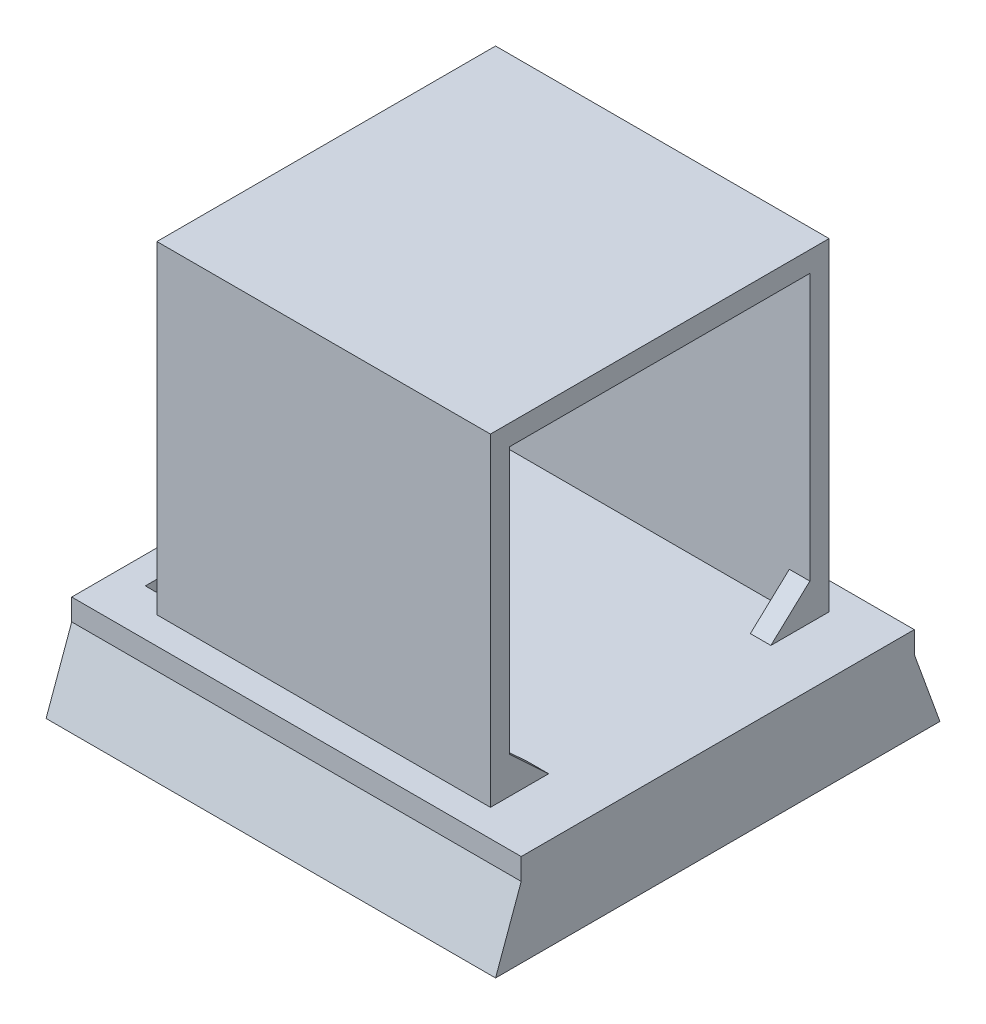
ISO-10303-21;
HEADER;
FILE_DESCRIPTION(('STEP AP214'),'2;1');
FILE_NAME('part.step','',(''),(''),'','','');
FILE_SCHEMA(('AUTOMOTIVE_DESIGN { 1 0 10303 214 1 1 1 1 }'));
ENDSEC;
DATA;
#1=APPLICATION_CONTEXT('core data for automotive mechanical design processes');
#2=APPLICATION_PROTOCOL_DEFINITION('international standard','automotive_design',2000,#1);
#3=PRODUCT_CONTEXT('',#1,'mechanical');
#4=PRODUCT('Part','Part','',(#3));
#5=PRODUCT_RELATED_PRODUCT_CATEGORY('part','',(#4));
#6=PRODUCT_DEFINITION_FORMATION('','',#4);
#7=PRODUCT_DEFINITION_CONTEXT('part definition',#1,'design');
#8=PRODUCT_DEFINITION('design','',#6,#7);
#9=PRODUCT_DEFINITION_SHAPE('','',#8);
#10=(LENGTH_UNIT() NAMED_UNIT(*) SI_UNIT(.MILLI.,.METRE.));
#11=(NAMED_UNIT(*) PLANE_ANGLE_UNIT() SI_UNIT($,.RADIAN.));
#12=(NAMED_UNIT(*) SI_UNIT($,.STERADIAN.) SOLID_ANGLE_UNIT());
#13=UNCERTAINTY_MEASURE_WITH_UNIT(LENGTH_MEASURE(1.E-05),#10,'distance_accuracy_value','');
#14=(GEOMETRIC_REPRESENTATION_CONTEXT(3) GLOBAL_UNCERTAINTY_ASSIGNED_CONTEXT((#13)) GLOBAL_UNIT_ASSIGNED_CONTEXT((#10,
#11,#12)) REPRESENTATION_CONTEXT('',''));
#15=CARTESIAN_POINT('',(0.,0.,0.));
#16=DIRECTION('',(0.,0.,1.));
#17=DIRECTION('',(1.,0.,0.));
#18=AXIS2_PLACEMENT_3D('',#15,#16,#17);
#19=CARTESIAN_POINT('',(-16.25,17.,2.65));
#20=DIRECTION('',(1.,0.,0.));
#21=DIRECTION('',(0.,1.,0.));
#22=AXIS2_PLACEMENT_3D('',#19,#20,#21);
#23=PLANE('',#22);
#24=DIRECTION('',(0.,1.,0.));
#25=VECTOR('',#24,1.);
#26=CARTESIAN_POINT('',(-16.25,17.,33.775));
#27=LINE('',#26,#25);
#28=CARTESIAN_POINT('',(-16.25,-14.5,33.775));
#29=VERTEX_POINT('',#28);
#30=CARTESIAN_POINT('',(-16.25,15.,33.775));
#31=VERTEX_POINT('',#30);
#32=EDGE_CURVE('E268',#29,#31,#27,.T.);
#33=ORIENTED_EDGE('',*,*,#32,.F.);
#34=DIRECTION('',(0.,0.,1.));
#35=VECTOR('',#34,1.);
#36=CARTESIAN_POINT('',(-16.25,-14.5,2.65));
#37=LINE('',#36,#35);
#38=CARTESIAN_POINT('',(-16.25,-14.5,35.65));
#39=VERTEX_POINT('',#38);
#40=EDGE_CURVE('E289',#29,#39,#37,.T.);
#41=ORIENTED_EDGE('',*,*,#40,.T.);
#42=DIRECTION('',(0.,1.,0.));
#43=VECTOR('',#42,1.);
#44=CARTESIAN_POINT('',(-16.25,17.,35.65));
#45=LINE('',#44,#43);
#46=CARTESIAN_POINT('',(-16.25,17.,35.65));
#47=VERTEX_POINT('',#46);
#48=EDGE_CURVE('E270',#39,#47,#45,.T.);
#49=ORIENTED_EDGE('',*,*,#48,.T.);
#50=DIRECTION('',(0.,0.,1.));
#51=VECTOR('',#50,1.);
#52=CARTESIAN_POINT('',(-16.25,17.,2.65));
#53=LINE('',#52,#51);
#54=CARTESIAN_POINT('',(-16.25,17.,2.65));
#55=VERTEX_POINT('',#54);
#56=EDGE_CURVE('E297',#55,#47,#53,.T.);
#57=ORIENTED_EDGE('',*,*,#56,.F.);
#58=DIRECTION('',(0.,1.,0.));
#59=VECTOR('',#58,1.);
#60=CARTESIAN_POINT('',(-16.25,17.,2.65));
#61=LINE('',#60,#59);
#62=CARTESIAN_POINT('',(-16.25,-14.5,2.65));
#63=VERTEX_POINT('',#62);
#64=EDGE_CURVE('E280',#63,#55,#61,.T.);
#65=ORIENTED_EDGE('',*,*,#64,.F.);
#66=CARTESIAN_POINT('',(-16.25,-14.5,4.52499999999999));
#67=VERTEX_POINT('',#66);
#68=EDGE_CURVE('E290',#63,#67,#37,.T.);
#69=ORIENTED_EDGE('',*,*,#68,.T.);
#70=DIRECTION('',(0.,1.,0.));
#71=VECTOR('',#70,1.);
#72=CARTESIAN_POINT('',(-16.25,17.,4.525));
#73=LINE('',#72,#71);
#74=CARTESIAN_POINT('',(-16.25,15.,4.525));
#75=VERTEX_POINT('',#74);
#76=EDGE_CURVE('E262',#67,#75,#73,.T.);
#77=ORIENTED_EDGE('',*,*,#76,.T.);
#78=DIRECTION('',(0.,0.,-1.));
#79=VECTOR('',#78,1.);
#80=CARTESIAN_POINT('',(-16.25,15.,2.65));
#81=LINE('',#80,#79);
#82=EDGE_CURVE('E265',#31,#75,#81,.T.);
#83=ORIENTED_EDGE('',*,*,#82,.F.);
#84=EDGE_LOOP('',(#33,#41,#49,#57,#65,#69,#77,#83));
#85=FACE_BOUND('',#84,.T.);
#86=ADVANCED_FACE('F38',(#85),#23,.F.);
#87=CARTESIAN_POINT('',(16.25,-14.5,2.65));
#88=DIRECTION('',(-1.,0.,0.));
#89=DIRECTION('',(0.,0.,1.));
#90=AXIS2_PLACEMENT_3D('',#87,#88,#89);
#91=PLANE('',#90);
#92=DIRECTION('',(0.,-1.,0.));
#93=VECTOR('',#92,1.);
#94=CARTESIAN_POINT('',(16.25,-14.5,4.52499999999999));
#95=LINE('',#94,#93);
#96=CARTESIAN_POINT('',(16.25,15.,4.525));
#97=VERTEX_POINT('',#96);
#98=CARTESIAN_POINT('',(16.25,-10.9710156832108,4.52499999999999));
#99=VERTEX_POINT('',#98);
#100=EDGE_CURVE('E347',#97,#99,#95,.T.);
#101=ORIENTED_EDGE('',*,*,#100,.T.);
#102=DIRECTION('',(0.,-0.680657373457638,0.732601897320604));
#103=VECTOR('',#102,1.);
#104=CARTESIAN_POINT('',(16.25,-10.9710156832108,4.52499999999999));
#105=LINE('',#104,#103);
#106=CARTESIAN_POINT('',(16.25,-14.5,8.32329956584661));
#107=VERTEX_POINT('',#106);
#108=EDGE_CURVE('E222',#99,#107,#105,.T.);
#109=ORIENTED_EDGE('',*,*,#108,.T.);
#110=DIRECTION('',(0.,0.,1.));
#111=VECTOR('',#110,1.);
#112=CARTESIAN_POINT('',(16.25,-14.5,2.65));
#113=LINE('',#112,#111);
#114=CARTESIAN_POINT('',(16.25,-14.5,2.65));
#115=VERTEX_POINT('',#114);
#116=EDGE_CURVE('E293',#115,#107,#113,.T.);
#117=ORIENTED_EDGE('',*,*,#116,.F.);
#118=DIRECTION('',(0.,-1.,0.));
#119=VECTOR('',#118,1.);
#120=CARTESIAN_POINT('',(16.25,-14.5,2.65));
#121=LINE('',#120,#119);
#122=CARTESIAN_POINT('',(16.25,17.,2.65));
#123=VERTEX_POINT('',#122);
#124=EDGE_CURVE('E285',#123,#115,#121,.T.);
#125=ORIENTED_EDGE('',*,*,#124,.F.);
#126=DIRECTION('',(0.,0.,1.));
#127=VECTOR('',#126,1.);
#128=CARTESIAN_POINT('',(16.25,17.,2.65));
#129=LINE('',#128,#127);
#130=CARTESIAN_POINT('',(16.25,17.,35.65));
#131=VERTEX_POINT('',#130);
#132=EDGE_CURVE('E295',#123,#131,#129,.T.);
#133=ORIENTED_EDGE('',*,*,#132,.T.);
#134=DIRECTION('',(0.,-1.,0.));
#135=VECTOR('',#134,1.);
#136=CARTESIAN_POINT('',(16.25,-14.5,35.65));
#137=LINE('',#136,#135);
#138=CARTESIAN_POINT('',(16.25,-14.5,35.65));
#139=VERTEX_POINT('',#138);
#140=EDGE_CURVE('E276',#131,#139,#137,.T.);
#141=ORIENTED_EDGE('',*,*,#140,.T.);
#142=CARTESIAN_POINT('',(16.25,-14.5,29.9767004341534));
#143=VERTEX_POINT('',#142);
#144=EDGE_CURVE('E61',#143,#139,#113,.T.);
#145=ORIENTED_EDGE('',*,*,#144,.F.);
#146=DIRECTION('',(0.,0.680657373457637,0.732601897320605));
#147=VECTOR('',#146,1.);
#148=CARTESIAN_POINT('',(16.25,-10.9710156832108,33.775));
#149=LINE('',#148,#147);
#150=CARTESIAN_POINT('',(16.25,-10.9710156832108,33.775));
#151=VERTEX_POINT('',#150);
#152=EDGE_CURVE('E238',#143,#151,#149,.T.);
#153=ORIENTED_EDGE('',*,*,#152,.T.);
#154=DIRECTION('',(0.,-1.,0.));
#155=VECTOR('',#154,1.);
#156=CARTESIAN_POINT('',(16.25,-14.5,33.775));
#157=LINE('',#156,#155);
#158=CARTESIAN_POINT('',(16.25,15.,33.775));
#159=VERTEX_POINT('',#158);
#160=EDGE_CURVE('E352',#159,#151,#157,.T.);
#161=ORIENTED_EDGE('',*,*,#160,.F.);
#162=DIRECTION('',(0.,0.,1.));
#163=VECTOR('',#162,1.);
#164=CARTESIAN_POINT('',(16.25,15.,2.65));
#165=LINE('',#164,#163);
#166=EDGE_CURVE('E350',#97,#159,#165,.T.);
#167=ORIENTED_EDGE('',*,*,#166,.F.);
#168=EDGE_LOOP('',(#101,#109,#117,#125,#133,#141,#145,#153,#161,#167));
#169=FACE_BOUND('',#168,.T.);
#170=ADVANCED_FACE('F392',(#169),#91,.F.);
#171=CARTESIAN_POINT('',(-21.9,-23.5,38.3));
#172=DIRECTION('',(0.,0.,-1.));
#173=DIRECTION('',(-1.,0.,0.));
#174=AXIS2_PLACEMENT_3D('',#171,#172,#173);
#175=PLANE('',#174);
#176=DIRECTION('',(-1.,0.,0.));
#177=VECTOR('',#176,1.);
#178=CARTESIAN_POINT('',(21.9,-16.6,38.3));
#179=LINE('',#178,#177);
#180=CARTESIAN_POINT('',(21.9,-16.6,38.3));
#181=VERTEX_POINT('',#180);
#182=CARTESIAN_POINT('',(-21.9,-16.6,38.3));
#183=VERTEX_POINT('',#182);
#184=EDGE_CURVE('E306',#181,#183,#179,.T.);
#185=ORIENTED_EDGE('',*,*,#184,.F.);
#186=DIRECTION('',(0.,1.,0.));
#187=VECTOR('',#186,1.);
#188=CARTESIAN_POINT('',(21.9,-23.5,38.3));
#189=LINE('',#188,#187);
#190=CARTESIAN_POINT('',(21.9,-14.5,38.3));
#191=VERTEX_POINT('',#190);
#192=EDGE_CURVE('E344',#181,#191,#189,.T.);
#193=ORIENTED_EDGE('',*,*,#192,.T.);
#194=DIRECTION('',(-1.,0.,0.));
#195=VECTOR('',#194,1.);
#196=CARTESIAN_POINT('',(-21.9,-14.5,38.3));
#197=LINE('',#196,#195);
#198=CARTESIAN_POINT('',(-21.9,-14.5,38.3));
#199=VERTEX_POINT('',#198);
#200=EDGE_CURVE('E331',#191,#199,#197,.T.);
#201=ORIENTED_EDGE('',*,*,#200,.T.);
#202=DIRECTION('',(0.,1.,0.));
#203=VECTOR('',#202,1.);
#204=CARTESIAN_POINT('',(-21.9,-23.5,38.3));
#205=LINE('',#204,#203);
#206=EDGE_CURVE('E342',#183,#199,#205,.T.);
#207=ORIENTED_EDGE('',*,*,#206,.F.);
#208=EDGE_LOOP('',(#185,#193,#201,#207));
#209=FACE_BOUND('',#208,.T.);
#210=ADVANCED_FACE('F424',(#209),#175,.F.);
#211=CARTESIAN_POINT('',(0.,0.,0.));
#212=DIRECTION('',(0.,0.,1.));
#213=DIRECTION('',(1.,0.,0.));
#214=AXIS2_PLACEMENT_3D('',#211,#212,#213);
#215=PLANE('',#214);
#216=DIRECTION('',(1.,0.,0.));
#217=VECTOR('',#216,1.);
#218=CARTESIAN_POINT('',(-21.9,-14.5,0.));
#219=LINE('',#218,#217);
#220=CARTESIAN_POINT('',(-21.9,-14.5,0.));
#221=VERTEX_POINT('',#220);
#222=CARTESIAN_POINT('',(21.9,-14.5,0.));
#223=VERTEX_POINT('',#222);
#224=EDGE_CURVE('E327',#221,#223,#219,.T.);
#225=ORIENTED_EDGE('',*,*,#224,.T.);
#226=DIRECTION('',(0.,1.,0.));
#227=VECTOR('',#226,1.);
#228=CARTESIAN_POINT('',(21.9,-23.5,0.));
#229=LINE('',#228,#227);
#230=CARTESIAN_POINT('',(21.9,-16.6,0.));
#231=VERTEX_POINT('',#230);
#232=EDGE_CURVE('E329',#231,#223,#229,.T.);
#233=ORIENTED_EDGE('',*,*,#232,.F.);
#234=DIRECTION('',(-1.,0.,0.));
#235=VECTOR('',#234,1.);
#236=CARTESIAN_POINT('',(21.9,-16.6,0.));
#237=LINE('',#236,#235);
#238=CARTESIAN_POINT('',(-21.9,-16.6,0.));
#239=VERTEX_POINT('',#238);
#240=EDGE_CURVE('E315',#231,#239,#237,.T.);
#241=ORIENTED_EDGE('',*,*,#240,.T.);
#242=DIRECTION('',(0.,1.,0.));
#243=VECTOR('',#242,1.);
#244=CARTESIAN_POINT('',(-21.9,-23.5,0.));
#245=LINE('',#244,#243);
#246=EDGE_CURVE('E339',#239,#221,#245,.T.);
#247=ORIENTED_EDGE('',*,*,#246,.T.);
#248=EDGE_LOOP('',(#225,#233,#241,#247));
#249=FACE_BOUND('',#248,.T.);
#250=ADVANCED_FACE('F40',(#249),#215,.F.);
#251=CARTESIAN_POINT('',(21.9,-23.5,38.3));
#252=DIRECTION('',(-1.,0.,0.));
#253=DIRECTION('',(0.,0.,1.));
#254=AXIS2_PLACEMENT_3D('',#251,#252,#253);
#255=PLANE('',#254);
#256=DIRECTION('',(0.,0.,1.));
#257=VECTOR('',#256,1.);
#258=CARTESIAN_POINT('',(21.9,-14.5,38.3));
#259=LINE('',#258,#257);
#260=EDGE_CURVE('E321',#223,#191,#259,.T.);
#261=ORIENTED_EDGE('',*,*,#260,.T.);
#262=ORIENTED_EDGE('',*,*,#192,.F.);
#263=DIRECTION('',(0.,0.940190624657783,-0.340648777049921));
#264=VECTOR('',#263,1.);
#265=CARTESIAN_POINT('',(21.9,-16.6,38.3));
#266=LINE('',#265,#264);
#267=CARTESIAN_POINT('',(21.9,-23.5,40.8));
#268=VERTEX_POINT('',#267);
#269=EDGE_CURVE('E300',#268,#181,#266,.T.);
#270=ORIENTED_EDGE('',*,*,#269,.F.);
#271=DIRECTION('',(0.,0.,1.));
#272=VECTOR('',#271,1.);
#273=CARTESIAN_POINT('',(21.9,-23.5,38.3));
#274=LINE('',#273,#272);
#275=CARTESIAN_POINT('',(21.9,-23.5,-2.5));
#276=VERTEX_POINT('',#275);
#277=EDGE_CURVE('E324',#276,#268,#274,.T.);
#278=ORIENTED_EDGE('',*,*,#277,.F.);
#279=DIRECTION('',(0.,-0.940190624657783,-0.340648777049922));
#280=VECTOR('',#279,1.);
#281=CARTESIAN_POINT('',(21.9,-16.6,0.));
#282=LINE('',#281,#280);
#283=EDGE_CURVE('E312',#231,#276,#282,.T.);
#284=ORIENTED_EDGE('',*,*,#283,.F.);
#285=ORIENTED_EDGE('',*,*,#232,.T.);
#286=EDGE_LOOP('',(#261,#262,#270,#278,#284,#285));
#287=FACE_BOUND('',#286,.T.);
#288=ADVANCED_FACE('F438',(#287),#255,.F.);
#289=CARTESIAN_POINT('',(-21.9,-23.5,0.));
#290=DIRECTION('',(1.,0.,0.));
#291=DIRECTION('',(0.,0.,-1.));
#292=AXIS2_PLACEMENT_3D('',#289,#290,#291);
#293=PLANE('',#292);
#294=DIRECTION('',(0.,0.,-1.));
#295=VECTOR('',#294,1.);
#296=CARTESIAN_POINT('',(-21.9,-14.5,0.));
#297=LINE('',#296,#295);
#298=EDGE_CURVE('E334',#199,#221,#297,.T.);
#299=ORIENTED_EDGE('',*,*,#298,.T.);
#300=ORIENTED_EDGE('',*,*,#246,.F.);
#301=DIRECTION('',(0.,-0.940190624657783,-0.340648777049922));
#302=VECTOR('',#301,1.);
#303=CARTESIAN_POINT('',(-21.9,-16.6,0.));
#304=LINE('',#303,#302);
#305=CARTESIAN_POINT('',(-21.9,-23.5,-2.5));
#306=VERTEX_POINT('',#305);
#307=EDGE_CURVE('E309',#239,#306,#304,.T.);
#308=ORIENTED_EDGE('',*,*,#307,.T.);
#309=DIRECTION('',(0.,0.,-1.));
#310=VECTOR('',#309,1.);
#311=CARTESIAN_POINT('',(-21.9,-23.5,0.));
#312=LINE('',#311,#310);
#313=CARTESIAN_POINT('',(-21.9,-23.5,40.8));
#314=VERTEX_POINT('',#313);
#315=EDGE_CURVE('E326',#314,#306,#312,.T.);
#316=ORIENTED_EDGE('',*,*,#315,.F.);
#317=DIRECTION('',(0.,0.940190624657783,-0.340648777049921));
#318=VECTOR('',#317,1.);
#319=CARTESIAN_POINT('',(-21.9,-16.6,38.3));
#320=LINE('',#319,#318);
#321=EDGE_CURVE('E299',#314,#183,#320,.T.);
#322=ORIENTED_EDGE('',*,*,#321,.T.);
#323=ORIENTED_EDGE('',*,*,#206,.T.);
#324=EDGE_LOOP('',(#299,#300,#308,#316,#322,#323));
#325=FACE_BOUND('',#324,.T.);
#326=ADVANCED_FACE('F432',(#325),#293,.F.);
#327=CARTESIAN_POINT('',(0.,-23.5,0.));
#328=DIRECTION('',(0.,-1.,0.));
#329=DIRECTION('',(0.,0.,-1.));
#330=AXIS2_PLACEMENT_3D('',#327,#328,#329);
#331=PLANE('',#330);
#332=ORIENTED_EDGE('',*,*,#277,.T.);
#333=DIRECTION('',(-1.,0.,0.));
#334=VECTOR('',#333,1.);
#335=CARTESIAN_POINT('',(21.9,-23.5,40.8));
#336=LINE('',#335,#334);
#337=EDGE_CURVE('E303',#268,#314,#336,.T.);
#338=ORIENTED_EDGE('',*,*,#337,.T.);
#339=ORIENTED_EDGE('',*,*,#315,.T.);
#340=DIRECTION('',(-1.,0.,0.));
#341=VECTOR('',#340,1.);
#342=CARTESIAN_POINT('',(21.9,-23.5,-2.5));
#343=LINE('',#342,#341);
#344=EDGE_CURVE('E318',#276,#306,#343,.T.);
#345=ORIENTED_EDGE('',*,*,#344,.F.);
#346=EDGE_LOOP('',(#332,#338,#339,#345));
#347=FACE_BOUND('',#346,.T.);
#348=ADVANCED_FACE('F429',(#347),#331,.T.);
#349=CARTESIAN_POINT('',(0.,-14.5,0.));
#350=DIRECTION('',(0.,-1.,0.));
#351=DIRECTION('',(0.,0.,-1.));
#352=AXIS2_PLACEMENT_3D('',#349,#350,#351);
#353=PLANE('',#352);
#354=DIRECTION('',(1.,0.,0.));
#355=VECTOR('',#354,1.);
#356=CARTESIAN_POINT('',(-21.9,-14.5,4.52499999999999));
#357=LINE('',#356,#355);
#358=CARTESIAN_POINT('',(14.25,-14.5,4.52499999999999));
#359=VERTEX_POINT('',#358);
#360=EDGE_CURVE('E250',#67,#359,#357,.T.);
#361=ORIENTED_EDGE('',*,*,#360,.F.);
#362=DIRECTION('',(0.,0.,-1.));
#363=VECTOR('',#362,1.);
#364=CARTESIAN_POINT('',(-16.25,-14.5,4.525));
#365=LINE('',#364,#363);
#366=EDGE_CURVE('E190',#29,#67,#365,.T.);
#367=ORIENTED_EDGE('',*,*,#366,.F.);
#368=DIRECTION('',(1.,0.,0.));
#369=VECTOR('',#368,1.);
#370=CARTESIAN_POINT('',(-21.9,-14.5,33.775));
#371=LINE('',#370,#369);
#372=CARTESIAN_POINT('',(14.25,-14.5,33.775));
#373=VERTEX_POINT('',#372);
#374=EDGE_CURVE('E260',#29,#373,#371,.T.);
#375=ORIENTED_EDGE('',*,*,#374,.T.);
#376=DIRECTION('',(0.,0.,-1.));
#377=VECTOR('',#376,1.);
#378=CARTESIAN_POINT('',(14.25,-14.5,29.9767004341534));
#379=LINE('',#378,#377);
#380=CARTESIAN_POINT('',(14.25,-14.5,29.9767004341534));
#381=VERTEX_POINT('',#380);
#382=EDGE_CURVE('E53',#373,#381,#379,.T.);
#383=ORIENTED_EDGE('',*,*,#382,.T.);
#384=DIRECTION('',(1.,0.,0.));
#385=VECTOR('',#384,1.);
#386=CARTESIAN_POINT('',(14.25,-14.5,29.9767004341534));
#387=LINE('',#386,#385);
#388=EDGE_CURVE('E245',#381,#143,#387,.T.);
#389=ORIENTED_EDGE('',*,*,#388,.T.);
#390=ORIENTED_EDGE('',*,*,#144,.T.);
#391=DIRECTION('',(-1.,0.,0.));
#392=VECTOR('',#391,1.);
#393=CARTESIAN_POINT('',(16.25,-14.5,35.65));
#394=LINE('',#393,#392);
#395=EDGE_CURVE('E278',#139,#39,#394,.T.);
#396=ORIENTED_EDGE('',*,*,#395,.T.);
#397=ORIENTED_EDGE('',*,*,#40,.F.);
#398=DIRECTION('',(1.,0.,0.));
#399=VECTOR('',#398,1.);
#400=CARTESIAN_POINT('',(-16.25,-14.5,33.775));
#401=LINE('',#400,#399);
#402=CARTESIAN_POINT('',(-19.25,-14.5,33.775));
#403=VERTEX_POINT('',#402);
#404=EDGE_CURVE('E207',#403,#29,#401,.T.);
#405=ORIENTED_EDGE('',*,*,#404,.F.);
#406=DIRECTION('',(0.,0.,1.));
#407=VECTOR('',#406,1.);
#408=CARTESIAN_POINT('',(-19.25,-14.5,4.525));
#409=LINE('',#408,#407);
#410=CARTESIAN_POINT('',(-19.25,-14.5,4.525));
#411=VERTEX_POINT('',#410);
#412=EDGE_CURVE('E210',#411,#403,#409,.T.);
#413=ORIENTED_EDGE('',*,*,#412,.F.);
#414=DIRECTION('',(-1.,0.,0.));
#415=VECTOR('',#414,1.);
#416=CARTESIAN_POINT('',(-16.25,-14.5,4.525));
#417=LINE('',#416,#415);
#418=EDGE_CURVE('E216',#67,#411,#417,.T.);
#419=ORIENTED_EDGE('',*,*,#418,.F.);
#420=ORIENTED_EDGE('',*,*,#68,.F.);
#421=DIRECTION('',(-1.,0.,0.));
#422=VECTOR('',#421,1.);
#423=CARTESIAN_POINT('',(16.25,-14.5,2.65));
#424=LINE('',#423,#422);
#425=EDGE_CURVE('E287',#115,#63,#424,.T.);
#426=ORIENTED_EDGE('',*,*,#425,.F.);
#427=ORIENTED_EDGE('',*,*,#116,.T.);
#428=DIRECTION('',(1.,0.,0.));
#429=VECTOR('',#428,1.);
#430=CARTESIAN_POINT('',(14.25,-14.5,8.32329956584661));
#431=LINE('',#430,#429);
#432=CARTESIAN_POINT('',(14.25,-14.5,8.32329956584661));
#433=VERTEX_POINT('',#432);
#434=EDGE_CURVE('E235',#433,#107,#431,.T.);
#435=ORIENTED_EDGE('',*,*,#434,.F.);
#436=DIRECTION('',(0.,0.,-1.));
#437=VECTOR('',#436,1.);
#438=CARTESIAN_POINT('',(14.25,-14.5,8.32329956584661));
#439=LINE('',#438,#437);
#440=EDGE_CURVE('E229',#433,#359,#439,.T.);
#441=ORIENTED_EDGE('',*,*,#440,.T.);
#442=EDGE_LOOP('',(#361,#367,#375,#383,#389,#390,#396,#397,#405,#413,#419,#420,#426,#427,#435,#441));
#443=FACE_BOUND('',#442,.T.);
#444=ORIENTED_EDGE('',*,*,#224,.F.);
#445=ORIENTED_EDGE('',*,*,#298,.F.);
#446=ORIENTED_EDGE('',*,*,#200,.F.);
#447=ORIENTED_EDGE('',*,*,#260,.F.);
#448=EDGE_LOOP('',(#444,#445,#446,#447));
#449=FACE_BOUND('',#448,.T.);
#450=ADVANCED_FACE('F363',(#443,#449),#353,.F.);
#451=CARTESIAN_POINT('',(21.9,-16.6,0.));
#452=DIRECTION('',(0.,0.340648777049922,-0.940190624657783));
#453=DIRECTION('',(0.,0.940190624657783,0.340648777049922));
#454=AXIS2_PLACEMENT_3D('',#451,#452,#453);
#455=PLANE('',#454);
#456=ORIENTED_EDGE('',*,*,#307,.F.);
#457=ORIENTED_EDGE('',*,*,#240,.F.);
#458=ORIENTED_EDGE('',*,*,#283,.T.);
#459=ORIENTED_EDGE('',*,*,#344,.T.);
#460=EDGE_LOOP('',(#456,#457,#458,#459));
#461=FACE_BOUND('',#460,.T.);
#462=ADVANCED_FACE('F415',(#461),#455,.T.);
#463=CARTESIAN_POINT('',(21.9,-16.6,38.3));
#464=DIRECTION('',(0.,0.340648777049921,0.940190624657783));
#465=DIRECTION('',(0.,-0.940190624657784,0.340648777049921));
#466=AXIS2_PLACEMENT_3D('',#463,#464,#465);
#467=PLANE('',#466);
#468=ORIENTED_EDGE('',*,*,#321,.F.);
#469=ORIENTED_EDGE('',*,*,#337,.F.);
#470=ORIENTED_EDGE('',*,*,#269,.T.);
#471=ORIENTED_EDGE('',*,*,#184,.T.);
#472=EDGE_LOOP('',(#468,#469,#470,#471));
#473=FACE_BOUND('',#472,.T.);
#474=ADVANCED_FACE('F408',(#473),#467,.T.);
#475=CARTESIAN_POINT('',(16.25,17.,2.65));
#476=DIRECTION('',(0.,-1.,0.));
#477=DIRECTION('',(0.,0.,-1.));
#478=AXIS2_PLACEMENT_3D('',#475,#476,#477);
#479=PLANE('',#478);
#480=ORIENTED_EDGE('',*,*,#56,.T.);
#481=DIRECTION('',(1.,0.,0.));
#482=VECTOR('',#481,1.);
#483=CARTESIAN_POINT('',(16.25,17.,35.65));
#484=LINE('',#483,#482);
#485=EDGE_CURVE('E273',#47,#131,#484,.T.);
#486=ORIENTED_EDGE('',*,*,#485,.T.);
#487=ORIENTED_EDGE('',*,*,#132,.F.);
#488=DIRECTION('',(1.,0.,0.));
#489=VECTOR('',#488,1.);
#490=CARTESIAN_POINT('',(16.25,17.,2.65));
#491=LINE('',#490,#489);
#492=EDGE_CURVE('E283',#55,#123,#491,.T.);
#493=ORIENTED_EDGE('',*,*,#492,.F.);
#494=EDGE_LOOP('',(#480,#486,#487,#493));
#495=FACE_BOUND('',#494,.T.);
#496=ADVANCED_FACE('F406',(#495),#479,.F.);
#497=CARTESIAN_POINT('',(0.,0.,2.65));
#498=DIRECTION('',(0.,0.,-1.));
#499=DIRECTION('',(-1.,0.,0.));
#500=AXIS2_PLACEMENT_3D('',#497,#498,#499);
#501=PLANE('',#500);
#502=ORIENTED_EDGE('',*,*,#124,.T.);
#503=ORIENTED_EDGE('',*,*,#425,.T.);
#504=ORIENTED_EDGE('',*,*,#64,.T.);
#505=ORIENTED_EDGE('',*,*,#492,.T.);
#506=EDGE_LOOP('',(#502,#503,#504,#505));
#507=FACE_BOUND('',#506,.T.);
#508=ADVANCED_FACE('F403',(#507),#501,.T.);
#509=CARTESIAN_POINT('',(0.,0.,35.65));
#510=DIRECTION('',(0.,0.,-1.));
#511=DIRECTION('',(-1.,0.,0.));
#512=AXIS2_PLACEMENT_3D('',#509,#510,#511);
#513=PLANE('',#512);
#514=ORIENTED_EDGE('',*,*,#395,.F.);
#515=ORIENTED_EDGE('',*,*,#140,.F.);
#516=ORIENTED_EDGE('',*,*,#485,.F.);
#517=ORIENTED_EDGE('',*,*,#48,.F.);
#518=EDGE_LOOP('',(#514,#515,#516,#517));
#519=FACE_BOUND('',#518,.T.);
#520=ADVANCED_FACE('F371',(#519),#513,.F.);
#521=CARTESIAN_POINT('',(-21.9,-14.5,33.775));
#522=DIRECTION('',(0.,0.,-1.));
#523=DIRECTION('',(-1.,0.,0.));
#524=AXIS2_PLACEMENT_3D('',#521,#522,#523);
#525=PLANE('',#524);
#526=DIRECTION('',(1.,0.,0.));
#527=VECTOR('',#526,1.);
#528=CARTESIAN_POINT('',(14.25,-10.9710156832108,33.775));
#529=LINE('',#528,#527);
#530=CARTESIAN_POINT('',(14.25,-10.9710156832108,33.775));
#531=VERTEX_POINT('',#530);
#532=EDGE_CURVE('E247',#531,#151,#529,.T.);
#533=ORIENTED_EDGE('',*,*,#532,.F.);
#534=DIRECTION('',(0.,1.,0.));
#535=VECTOR('',#534,1.);
#536=CARTESIAN_POINT('',(14.25,-14.5,33.775));
#537=LINE('',#536,#535);
#538=EDGE_CURVE('E46',#373,#531,#537,.T.);
#539=ORIENTED_EDGE('',*,*,#538,.F.);
#540=ORIENTED_EDGE('',*,*,#374,.F.);
#541=ORIENTED_EDGE('',*,*,#32,.T.);
#542=DIRECTION('',(1.,0.,0.));
#543=VECTOR('',#542,1.);
#544=CARTESIAN_POINT('',(-21.9,15.,33.775));
#545=LINE('',#544,#543);
#546=EDGE_CURVE('E257',#31,#159,#545,.T.);
#547=ORIENTED_EDGE('',*,*,#546,.T.);
#548=ORIENTED_EDGE('',*,*,#160,.T.);
#549=EDGE_LOOP('',(#533,#539,#540,#541,#547,#548));
#550=FACE_BOUND('',#549,.T.);
#551=ADVANCED_FACE('F382',(#550),#525,.T.);
#552=CARTESIAN_POINT('',(-21.9,15.,33.775));
#553=DIRECTION('',(0.,-1.,0.));
#554=DIRECTION('',(0.,0.,-1.));
#555=AXIS2_PLACEMENT_3D('',#552,#553,#554);
#556=PLANE('',#555);
#557=ORIENTED_EDGE('',*,*,#82,.T.);
#558=DIRECTION('',(1.,0.,0.));
#559=VECTOR('',#558,1.);
#560=CARTESIAN_POINT('',(-21.9,15.,4.525));
#561=LINE('',#560,#559);
#562=EDGE_CURVE('E254',#75,#97,#561,.T.);
#563=ORIENTED_EDGE('',*,*,#562,.T.);
#564=ORIENTED_EDGE('',*,*,#166,.T.);
#565=ORIENTED_EDGE('',*,*,#546,.F.);
#566=EDGE_LOOP('',(#557,#563,#564,#565));
#567=FACE_BOUND('',#566,.T.);
#568=ADVANCED_FACE('F386',(#567),#556,.T.);
#569=CARTESIAN_POINT('',(-21.9,-14.5,4.52499999999999));
#570=DIRECTION('',(0.,0.,-1.));
#571=DIRECTION('',(0.,1.,0.));
#572=AXIS2_PLACEMENT_3D('',#569,#570,#571);
#573=PLANE('',#572);
#574=DIRECTION('',(0.,1.,0.));
#575=VECTOR('',#574,1.);
#576=CARTESIAN_POINT('',(14.25,-14.5,4.52499999999999));
#577=LINE('',#576,#575);
#578=CARTESIAN_POINT('',(14.25,-10.9710156832108,4.52499999999999));
#579=VERTEX_POINT('',#578);
#580=EDGE_CURVE('E11',#359,#579,#577,.T.);
#581=ORIENTED_EDGE('',*,*,#580,.T.);
#582=DIRECTION('',(1.,0.,0.));
#583=VECTOR('',#582,1.);
#584=CARTESIAN_POINT('',(14.25,-10.9710156832108,4.52499999999999));
#585=LINE('',#584,#583);
#586=EDGE_CURVE('E232',#579,#99,#585,.T.);
#587=ORIENTED_EDGE('',*,*,#586,.T.);
#588=ORIENTED_EDGE('',*,*,#100,.F.);
#589=ORIENTED_EDGE('',*,*,#562,.F.);
#590=ORIENTED_EDGE('',*,*,#76,.F.);
#591=ORIENTED_EDGE('',*,*,#360,.T.);
#592=EDGE_LOOP('',(#581,#587,#588,#589,#590,#591));
#593=FACE_BOUND('',#592,.T.);
#594=ADVANCED_FACE('F391',(#593),#573,.F.);
#595=CARTESIAN_POINT('',(14.25,-10.9710156832108,33.775));
#596=DIRECTION('',(0.,0.732601897320605,-0.680657373457637));
#597=DIRECTION('',(0.,0.680657373457637,0.732601897320605));
#598=AXIS2_PLACEMENT_3D('',#595,#596,#597);
#599=PLANE('',#598);
#600=ORIENTED_EDGE('',*,*,#152,.F.);
#601=ORIENTED_EDGE('',*,*,#388,.F.);
#602=DIRECTION('',(0.,0.680657373457637,0.732601897320605));
#603=VECTOR('',#602,1.);
#604=CARTESIAN_POINT('',(14.25,-10.9710156832108,33.775));
#605=LINE('',#604,#603);
#606=EDGE_CURVE('E242',#381,#531,#605,.T.);
#607=ORIENTED_EDGE('',*,*,#606,.T.);
#608=ORIENTED_EDGE('',*,*,#532,.T.);
#609=EDGE_LOOP('',(#600,#601,#607,#608));
#610=FACE_BOUND('',#609,.T.);
#611=ADVANCED_FACE('F361',(#610),#599,.T.);
#612=CARTESIAN_POINT('',(14.25,0.,0.));
#613=DIRECTION('',(-1.,0.,0.));
#614=DIRECTION('',(0.,0.,1.));
#615=AXIS2_PLACEMENT_3D('',#612,#613,#614);
#616=PLANE('',#615);
#617=ORIENTED_EDGE('',*,*,#382,.F.);
#618=ORIENTED_EDGE('',*,*,#538,.T.);
#619=ORIENTED_EDGE('',*,*,#606,.F.);
#620=EDGE_LOOP('',(#617,#618,#619));
#621=FACE_BOUND('',#620,.T.);
#622=ADVANCED_FACE('F356',(#621),#616,.T.);
#623=CARTESIAN_POINT('',(14.25,0.,0.));
#624=DIRECTION('',(-1.,0.,0.));
#625=DIRECTION('',(0.,0.,1.));
#626=AXIS2_PLACEMENT_3D('',#623,#624,#625);
#627=PLANE('',#626);
#628=ORIENTED_EDGE('',*,*,#580,.F.);
#629=ORIENTED_EDGE('',*,*,#440,.F.);
#630=DIRECTION('',(0.,-0.680657373457638,0.732601897320604));
#631=VECTOR('',#630,1.);
#632=CARTESIAN_POINT('',(14.25,-10.9710156832108,4.52499999999999));
#633=LINE('',#632,#631);
#634=EDGE_CURVE('E226',#579,#433,#633,.T.);
#635=ORIENTED_EDGE('',*,*,#634,.F.);
#636=EDGE_LOOP('',(#628,#629,#635));
#637=FACE_BOUND('',#636,.T.);
#638=ADVANCED_FACE('F400',(#637),#627,.T.);
#639=CARTESIAN_POINT('',(14.25,-10.9710156832108,4.52499999999999));
#640=DIRECTION('',(0.,0.732601897320604,0.680657373457639));
#641=DIRECTION('',(0.,-0.680657373457639,0.732601897320604));
#642=AXIS2_PLACEMENT_3D('',#639,#640,#641);
#643=PLANE('',#642);
#644=ORIENTED_EDGE('',*,*,#108,.F.);
#645=ORIENTED_EDGE('',*,*,#586,.F.);
#646=ORIENTED_EDGE('',*,*,#634,.T.);
#647=ORIENTED_EDGE('',*,*,#434,.T.);
#648=EDGE_LOOP('',(#644,#645,#646,#647));
#649=FACE_BOUND('',#648,.T.);
#650=ADVANCED_FACE('F396',(#649),#643,.T.);
#651=CARTESIAN_POINT('',(-16.25,-16.5,4.525));
#652=DIRECTION('',(1.,0.,0.));
#653=DIRECTION('',(0.,0.,-1.));
#654=AXIS2_PLACEMENT_3D('',#651,#652,#653);
#655=PLANE('',#654);
#656=ORIENTED_EDGE('',*,*,#366,.T.);
#657=DIRECTION('',(0.,1.,0.));
#658=VECTOR('',#657,1.);
#659=CARTESIAN_POINT('',(-16.25,-16.5,4.525));
#660=LINE('',#659,#658);
#661=CARTESIAN_POINT('',(-16.25,-16.5,4.525));
#662=VERTEX_POINT('',#661);
#663=EDGE_CURVE('E183',#662,#67,#660,.T.);
#664=ORIENTED_EDGE('',*,*,#663,.F.);
#665=DIRECTION('',(0.,0.,-1.));
#666=VECTOR('',#665,1.);
#667=CARTESIAN_POINT('',(-16.25,-16.5,4.525));
#668=LINE('',#667,#666);
#669=CARTESIAN_POINT('',(-16.25,-16.5,33.775));
#670=VERTEX_POINT('',#669);
#671=EDGE_CURVE('E187',#670,#662,#668,.T.);
#672=ORIENTED_EDGE('',*,*,#671,.F.);
#673=DIRECTION('',(0.,1.,0.));
#674=VECTOR('',#673,1.);
#675=CARTESIAN_POINT('',(-16.25,-16.5,33.775));
#676=LINE('',#675,#674);
#677=EDGE_CURVE('E220',#670,#29,#676,.T.);
#678=ORIENTED_EDGE('',*,*,#677,.T.);
#679=EDGE_LOOP('',(#656,#664,#672,#678));
#680=FACE_BOUND('',#679,.T.);
#681=ADVANCED_FACE('F185',(#680),#655,.F.);
#682=CARTESIAN_POINT('',(-16.25,-16.5,33.775));
#683=DIRECTION('',(0.,0.,1.));
#684=DIRECTION('',(1.,0.,0.));
#685=AXIS2_PLACEMENT_3D('',#682,#683,#684);
#686=PLANE('',#685);
#687=ORIENTED_EDGE('',*,*,#404,.T.);
#688=ORIENTED_EDGE('',*,*,#677,.F.);
#689=DIRECTION('',(1.,0.,0.));
#690=VECTOR('',#689,1.);
#691=CARTESIAN_POINT('',(-16.25,-16.5,33.775));
#692=LINE('',#691,#690);
#693=CARTESIAN_POINT('',(-19.25,-16.5,33.775));
#694=VERTEX_POINT('',#693);
#695=EDGE_CURVE('E195',#694,#670,#692,.T.);
#696=ORIENTED_EDGE('',*,*,#695,.F.);
#697=DIRECTION('',(0.,1.,0.));
#698=VECTOR('',#697,1.);
#699=CARTESIAN_POINT('',(-19.25,-16.5,33.775));
#700=LINE('',#699,#698);
#701=EDGE_CURVE('E223',#694,#403,#700,.T.);
#702=ORIENTED_EDGE('',*,*,#701,.T.);
#703=EDGE_LOOP('',(#687,#688,#696,#702));
#704=FACE_BOUND('',#703,.T.);
#705=ADVANCED_FACE('F381',(#704),#686,.F.);
#706=CARTESIAN_POINT('',(-19.25,-16.5,4.525));
#707=DIRECTION('',(-1.,0.,0.));
#708=DIRECTION('',(0.,0.,1.));
#709=AXIS2_PLACEMENT_3D('',#706,#707,#708);
#710=PLANE('',#709);
#711=ORIENTED_EDGE('',*,*,#412,.T.);
#712=ORIENTED_EDGE('',*,*,#701,.F.);
#713=DIRECTION('',(0.,0.,1.));
#714=VECTOR('',#713,1.);
#715=CARTESIAN_POINT('',(-19.25,-16.5,4.525));
#716=LINE('',#715,#714);
#717=CARTESIAN_POINT('',(-19.25,-16.5,4.525));
#718=VERTEX_POINT('',#717);
#719=EDGE_CURVE('E203',#718,#694,#716,.T.);
#720=ORIENTED_EDGE('',*,*,#719,.F.);
#721=DIRECTION('',(0.,1.,0.));
#722=VECTOR('',#721,1.);
#723=CARTESIAN_POINT('',(-19.25,-16.5,4.525));
#724=LINE('',#723,#722);
#725=EDGE_CURVE('E194',#718,#411,#724,.T.);
#726=ORIENTED_EDGE('',*,*,#725,.T.);
#727=EDGE_LOOP('',(#711,#712,#720,#726));
#728=FACE_BOUND('',#727,.T.);
#729=ADVANCED_FACE('F570',(#728),#710,.F.);
#730=CARTESIAN_POINT('',(-16.25,-16.5,4.525));
#731=DIRECTION('',(0.,0.,-1.));
#732=DIRECTION('',(-1.,0.,0.));
#733=AXIS2_PLACEMENT_3D('',#730,#731,#732);
#734=PLANE('',#733);
#735=ORIENTED_EDGE('',*,*,#418,.T.);
#736=ORIENTED_EDGE('',*,*,#725,.F.);
#737=DIRECTION('',(-1.,0.,0.));
#738=VECTOR('',#737,1.);
#739=CARTESIAN_POINT('',(-16.25,-16.5,4.525));
#740=LINE('',#739,#738);
#741=EDGE_CURVE('E198',#662,#718,#740,.T.);
#742=ORIENTED_EDGE('',*,*,#741,.F.);
#743=ORIENTED_EDGE('',*,*,#663,.T.);
#744=EDGE_LOOP('',(#735,#736,#742,#743));
#745=FACE_BOUND('',#744,.T.);
#746=ADVANCED_FACE('F199',(#745),#734,.F.);
#747=CARTESIAN_POINT('',(0.,-16.5,0.));
#748=DIRECTION('',(0.,-1.,0.));
#749=DIRECTION('',(0.,0.,-1.));
#750=AXIS2_PLACEMENT_3D('',#747,#748,#749);
#751=PLANE('',#750);
#752=ORIENTED_EDGE('',*,*,#671,.T.);
#753=ORIENTED_EDGE('',*,*,#741,.T.);
#754=ORIENTED_EDGE('',*,*,#719,.T.);
#755=ORIENTED_EDGE('',*,*,#695,.T.);
#756=EDGE_LOOP('',(#752,#753,#754,#755));
#757=FACE_BOUND('',#756,.T.);
#758=ADVANCED_FACE('F205',(#757),#751,.F.);
#759=CLOSED_SHELL('',(#86,#170,#210,#250,#288,#326,#348,#450,#462,#474,#496,#508,#520,#551,#568,
#594,#611,#622,#638,#650,#681,#705,#729,#746,#758));
#760=MANIFOLD_SOLID_BREP('B2',#759);
#761=ADVANCED_BREP_SHAPE_REPRESENTATION('',(#18,#760),#14);
#762=SHAPE_DEFINITION_REPRESENTATION(#9,#761);
ENDSEC;
END-ISO-10303-21;
